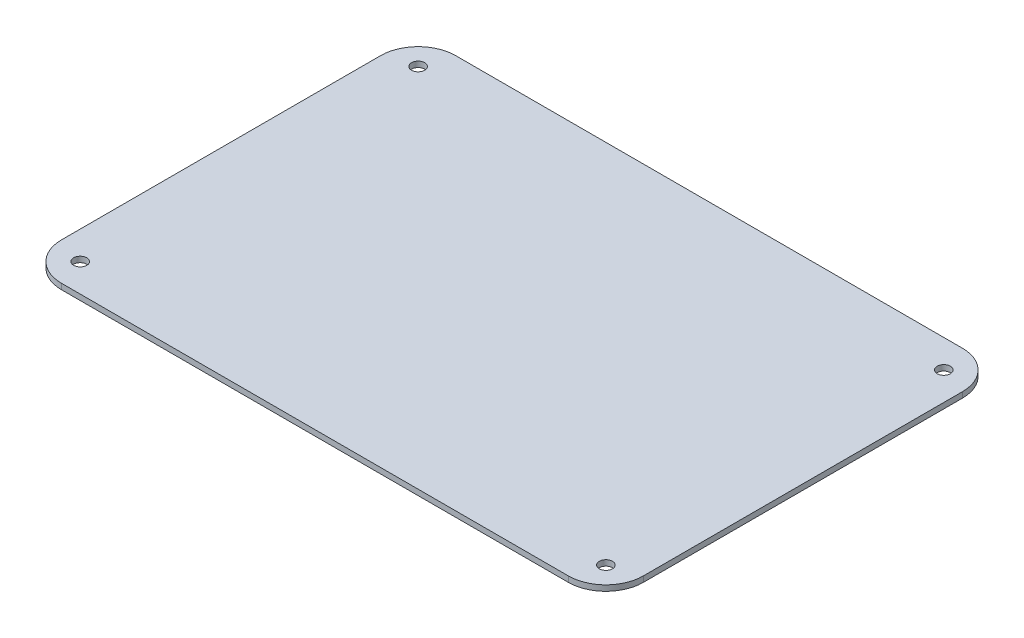
ISO-10303-21;
HEADER;
FILE_DESCRIPTION(('STEP AP214'),'2;1');
FILE_NAME('part.step','',(''),(''),'','','');
FILE_SCHEMA(('AUTOMOTIVE_DESIGN { 1 0 10303 214 1 1 1 1 }'));
ENDSEC;
DATA;
#1=APPLICATION_CONTEXT('core data for automotive mechanical design processes');
#2=APPLICATION_PROTOCOL_DEFINITION('international standard','automotive_design',2000,#1);
#3=PRODUCT_CONTEXT('',#1,'mechanical');
#4=PRODUCT('Part','Part','',(#3));
#5=PRODUCT_RELATED_PRODUCT_CATEGORY('part','',(#4));
#6=PRODUCT_DEFINITION_FORMATION('','',#4);
#7=PRODUCT_DEFINITION_CONTEXT('part definition',#1,'design');
#8=PRODUCT_DEFINITION('design','',#6,#7);
#9=PRODUCT_DEFINITION_SHAPE('','',#8);
#10=(LENGTH_UNIT() NAMED_UNIT(*) SI_UNIT(.MILLI.,.METRE.));
#11=(NAMED_UNIT(*) PLANE_ANGLE_UNIT() SI_UNIT($,.RADIAN.));
#12=(NAMED_UNIT(*) SI_UNIT($,.STERADIAN.) SOLID_ANGLE_UNIT());
#13=UNCERTAINTY_MEASURE_WITH_UNIT(LENGTH_MEASURE(1.E-05),#10,'distance_accuracy_value','');
#14=(GEOMETRIC_REPRESENTATION_CONTEXT(3) GLOBAL_UNCERTAINTY_ASSIGNED_CONTEXT((#13)) GLOBAL_UNIT_ASSIGNED_CONTEXT((#10,
#11,#12)) REPRESENTATION_CONTEXT('',''));
#15=CARTESIAN_POINT('',(0.,0.,0.));
#16=DIRECTION('',(0.,0.,1.));
#17=DIRECTION('',(1.,0.,0.));
#18=AXIS2_PLACEMENT_3D('',#15,#16,#17);
#19=CARTESIAN_POINT('',(0.,3.,0.));
#20=DIRECTION('',(0.,-1.,0.));
#21=DIRECTION('',(0.,0.,-1.));
#22=AXIS2_PLACEMENT_3D('',#19,#20,#21);
#23=PLANE('',#22);
#24=DIRECTION('',(1.,0.,0.));
#25=VECTOR('',#24,1.);
#26=CARTESIAN_POINT('',(155.,3.,105.));
#27=LINE('',#26,#25);
#28=CARTESIAN_POINT('',(-135.,3.,105.));
#29=VERTEX_POINT('',#28);
#30=CARTESIAN_POINT('',(135.,3.,105.));
#31=VERTEX_POINT('',#30);
#32=EDGE_CURVE('E194',#29,#31,#27,.T.);
#33=ORIENTED_EDGE('',*,*,#32,.T.);
#34=CARTESIAN_POINT('',(135.,3.,85.));
#35=DIRECTION('',(0.,-1.,0.));
#36=DIRECTION('',(0.,0.,-1.));
#37=AXIS2_PLACEMENT_3D('',#34,#35,#36);
#38=CIRCLE('',#37,20.);
#39=CARTESIAN_POINT('',(155.,3.,85.));
#40=VERTEX_POINT('',#39);
#41=EDGE_CURVE('E170',#31,#40,#38,.F.);
#42=ORIENTED_EDGE('',*,*,#41,.T.);
#43=DIRECTION('',(0.,0.,-1.));
#44=VECTOR('',#43,1.);
#45=CARTESIAN_POINT('',(155.,3.,-105.));
#46=LINE('',#45,#44);
#47=CARTESIAN_POINT('',(155.,3.,-85.));
#48=VERTEX_POINT('',#47);
#49=EDGE_CURVE('E127',#40,#48,#46,.T.);
#50=ORIENTED_EDGE('',*,*,#49,.T.);
#51=CARTESIAN_POINT('',(135.,3.,-85.));
#52=DIRECTION('',(0.,-1.,0.));
#53=DIRECTION('',(0.,0.,-1.));
#54=AXIS2_PLACEMENT_3D('',#51,#52,#53);
#55=CIRCLE('',#54,20.);
#56=CARTESIAN_POINT('',(135.,3.,-105.));
#57=VERTEX_POINT('',#56);
#58=EDGE_CURVE('E62',#48,#57,#55,.F.);
#59=ORIENTED_EDGE('',*,*,#58,.T.);
#60=DIRECTION('',(-1.,0.,0.));
#61=VECTOR('',#60,1.);
#62=CARTESIAN_POINT('',(155.,3.,-105.));
#63=LINE('',#62,#61);
#64=CARTESIAN_POINT('',(-135.,3.,-105.));
#65=VERTEX_POINT('',#64);
#66=EDGE_CURVE('E148',#57,#65,#63,.T.);
#67=ORIENTED_EDGE('',*,*,#66,.T.);
#68=CARTESIAN_POINT('',(-135.,3.,-85.));
#69=DIRECTION('',(0.,-1.,0.));
#70=DIRECTION('',(0.,0.,-1.));
#71=AXIS2_PLACEMENT_3D('',#68,#69,#70);
#72=CIRCLE('',#71,20.);
#73=CARTESIAN_POINT('',(-155.,3.,-85.));
#74=VERTEX_POINT('',#73);
#75=EDGE_CURVE('E165',#65,#74,#72,.F.);
#76=ORIENTED_EDGE('',*,*,#75,.T.);
#77=DIRECTION('',(0.,0.,1.));
#78=VECTOR('',#77,1.);
#79=CARTESIAN_POINT('',(-155.,3.,-105.));
#80=LINE('',#79,#78);
#81=CARTESIAN_POINT('',(-155.,3.,85.));
#82=VERTEX_POINT('',#81);
#83=EDGE_CURVE('E141',#74,#82,#80,.T.);
#84=ORIENTED_EDGE('',*,*,#83,.T.);
#85=CARTESIAN_POINT('',(-135.,3.,85.));
#86=DIRECTION('',(0.,-1.,0.));
#87=DIRECTION('',(0.,0.,-1.));
#88=AXIS2_PLACEMENT_3D('',#85,#86,#87);
#89=CIRCLE('',#88,20.);
#90=EDGE_CURVE('E162',#82,#29,#89,.F.);
#91=ORIENTED_EDGE('',*,*,#90,.T.);
#92=EDGE_LOOP('',(#33,#42,#50,#59,#67,#76,#84,#91));
#93=FACE_BOUND('',#92,.T.);
#94=CARTESIAN_POINT('',(-140.,3.,-90.));
#95=DIRECTION('',(0.,1.,0.));
#96=DIRECTION('',(0.,0.,1.));
#97=AXIS2_PLACEMENT_3D('',#94,#95,#96);
#98=CIRCLE('',#97,3.49999999999999);
#99=CARTESIAN_POINT('',(-140.,3.,-86.5));
#100=VERTEX_POINT('',#99);
#101=EDGE_CURVE('E200',#100,#100,#98,.T.);
#102=ORIENTED_EDGE('',*,*,#101,.F.);
#103=EDGE_LOOP('',(#102));
#104=FACE_BOUND('',#103,.T.);
#105=CARTESIAN_POINT('',(140.,3.,-90.));
#106=DIRECTION('',(0.,1.,0.));
#107=DIRECTION('',(0.,0.,1.));
#108=AXIS2_PLACEMENT_3D('',#105,#106,#107);
#109=CIRCLE('',#108,3.49999999999999);
#110=CARTESIAN_POINT('',(140.,3.,-86.5));
#111=VERTEX_POINT('',#110);
#112=EDGE_CURVE('E214',#111,#111,#109,.T.);
#113=ORIENTED_EDGE('',*,*,#112,.F.);
#114=EDGE_LOOP('',(#113));
#115=FACE_BOUND('',#114,.T.);
#116=CARTESIAN_POINT('',(140.,3.,90.));
#117=DIRECTION('',(0.,1.,0.));
#118=DIRECTION('',(0.,0.,1.));
#119=AXIS2_PLACEMENT_3D('',#116,#117,#118);
#120=CIRCLE('',#119,3.49999999999999);
#121=CARTESIAN_POINT('',(140.,3.,93.5));
#122=VERTEX_POINT('',#121);
#123=EDGE_CURVE('E220',#122,#122,#120,.T.);
#124=ORIENTED_EDGE('',*,*,#123,.F.);
#125=EDGE_LOOP('',(#124));
#126=FACE_BOUND('',#125,.T.);
#127=CARTESIAN_POINT('',(-140.,3.,90.));
#128=DIRECTION('',(0.,1.,0.));
#129=DIRECTION('',(0.,0.,1.));
#130=AXIS2_PLACEMENT_3D('',#127,#128,#129);
#131=CIRCLE('',#130,3.49999999999999);
#132=CARTESIAN_POINT('',(-140.,3.,93.5));
#133=VERTEX_POINT('',#132);
#134=EDGE_CURVE('E228',#133,#133,#131,.T.);
#135=ORIENTED_EDGE('',*,*,#134,.F.);
#136=EDGE_LOOP('',(#135));
#137=FACE_BOUND('',#136,.T.);
#138=ADVANCED_FACE('F39',(#93,#104,#115,#126,#137),#23,.F.);
#139=CARTESIAN_POINT('',(0.,0.,0.));
#140=DIRECTION('',(0.,-1.,0.));
#141=DIRECTION('',(0.,0.,-1.));
#142=AXIS2_PLACEMENT_3D('',#139,#140,#141);
#143=PLANE('',#142);
#144=CARTESIAN_POINT('',(140.,0.,90.));
#145=DIRECTION('',(0.,1.,0.));
#146=DIRECTION('',(0.,0.,1.));
#147=AXIS2_PLACEMENT_3D('',#144,#145,#146);
#148=CIRCLE('',#147,3.49999999999999);
#149=CARTESIAN_POINT('',(140.,0.,93.5));
#150=VERTEX_POINT('',#149);
#151=EDGE_CURVE('E224',#150,#150,#148,.T.);
#152=ORIENTED_EDGE('',*,*,#151,.T.);
#153=EDGE_LOOP('',(#152));
#154=FACE_BOUND('',#153,.T.);
#155=CARTESIAN_POINT('',(-140.,0.,-90.));
#156=DIRECTION('',(0.,1.,0.));
#157=DIRECTION('',(0.,0.,1.));
#158=AXIS2_PLACEMENT_3D('',#155,#156,#157);
#159=CIRCLE('',#158,3.49999999999999);
#160=CARTESIAN_POINT('',(-140.,0.,-86.5));
#161=VERTEX_POINT('',#160);
#162=EDGE_CURVE('E203',#161,#161,#159,.T.);
#163=ORIENTED_EDGE('',*,*,#162,.T.);
#164=EDGE_LOOP('',(#163));
#165=FACE_BOUND('',#164,.T.);
#166=DIRECTION('',(0.,0.,-1.));
#167=VECTOR('',#166,1.);
#168=CARTESIAN_POINT('',(155.,0.,-105.));
#169=LINE('',#168,#167);
#170=CARTESIAN_POINT('',(155.,0.,85.));
#171=VERTEX_POINT('',#170);
#172=CARTESIAN_POINT('',(155.,0.,-85.));
#173=VERTEX_POINT('',#172);
#174=EDGE_CURVE('E125',#171,#173,#169,.T.);
#175=ORIENTED_EDGE('',*,*,#174,.F.);
#176=CARTESIAN_POINT('',(135.,0.,85.));
#177=DIRECTION('',(0.,-1.,0.));
#178=DIRECTION('',(0.,0.,-1.));
#179=AXIS2_PLACEMENT_3D('',#176,#177,#178);
#180=CIRCLE('',#179,20.);
#181=CARTESIAN_POINT('',(135.,0.,105.));
#182=VERTEX_POINT('',#181);
#183=EDGE_CURVE('E107',#171,#182,#180,.T.);
#184=ORIENTED_EDGE('',*,*,#183,.T.);
#185=DIRECTION('',(1.,0.,0.));
#186=VECTOR('',#185,1.);
#187=CARTESIAN_POINT('',(155.,0.,105.));
#188=LINE('',#187,#186);
#189=CARTESIAN_POINT('',(-135.,0.,105.));
#190=VERTEX_POINT('',#189);
#191=EDGE_CURVE('E137',#190,#182,#188,.T.);
#192=ORIENTED_EDGE('',*,*,#191,.F.);
#193=CARTESIAN_POINT('',(-135.,0.,85.));
#194=DIRECTION('',(0.,-1.,0.));
#195=DIRECTION('',(0.,0.,-1.));
#196=AXIS2_PLACEMENT_3D('',#193,#194,#195);
#197=CIRCLE('',#196,20.);
#198=CARTESIAN_POINT('',(-155.,0.,85.));
#199=VERTEX_POINT('',#198);
#200=EDGE_CURVE('E129',#190,#199,#197,.T.);
#201=ORIENTED_EDGE('',*,*,#200,.T.);
#202=DIRECTION('',(0.,0.,1.));
#203=VECTOR('',#202,1.);
#204=CARTESIAN_POINT('',(-155.,0.,-105.));
#205=LINE('',#204,#203);
#206=CARTESIAN_POINT('',(-155.,0.,-85.));
#207=VERTEX_POINT('',#206);
#208=EDGE_CURVE('E143',#207,#199,#205,.T.);
#209=ORIENTED_EDGE('',*,*,#208,.F.);
#210=CARTESIAN_POINT('',(-135.,0.,-85.));
#211=DIRECTION('',(0.,-1.,0.));
#212=DIRECTION('',(0.,0.,-1.));
#213=AXIS2_PLACEMENT_3D('',#210,#211,#212);
#214=CIRCLE('',#213,20.);
#215=CARTESIAN_POINT('',(-135.,0.,-105.));
#216=VERTEX_POINT('',#215);
#217=EDGE_CURVE('E152',#207,#216,#214,.T.);
#218=ORIENTED_EDGE('',*,*,#217,.T.);
#219=DIRECTION('',(-1.,0.,0.));
#220=VECTOR('',#219,1.);
#221=CARTESIAN_POINT('',(155.,0.,-105.));
#222=LINE('',#221,#220);
#223=CARTESIAN_POINT('',(135.,0.,-105.));
#224=VERTEX_POINT('',#223);
#225=EDGE_CURVE('E136',#224,#216,#222,.T.);
#226=ORIENTED_EDGE('',*,*,#225,.F.);
#227=CARTESIAN_POINT('',(135.,0.,-85.));
#228=DIRECTION('',(0.,-1.,0.));
#229=DIRECTION('',(0.,0.,-1.));
#230=AXIS2_PLACEMENT_3D('',#227,#228,#229);
#231=CIRCLE('',#230,20.);
#232=EDGE_CURVE('E119',#224,#173,#231,.T.);
#233=ORIENTED_EDGE('',*,*,#232,.T.);
#234=EDGE_LOOP('',(#175,#184,#192,#201,#209,#218,#226,#233));
#235=FACE_BOUND('',#234,.T.);
#236=CARTESIAN_POINT('',(140.,0.,-90.));
#237=DIRECTION('',(0.,1.,0.));
#238=DIRECTION('',(0.,0.,1.));
#239=AXIS2_PLACEMENT_3D('',#236,#237,#238);
#240=CIRCLE('',#239,3.49999999999999);
#241=CARTESIAN_POINT('',(140.,0.,-86.5));
#242=VERTEX_POINT('',#241);
#243=EDGE_CURVE('E216',#242,#242,#240,.T.);
#244=ORIENTED_EDGE('',*,*,#243,.T.);
#245=EDGE_LOOP('',(#244));
#246=FACE_BOUND('',#245,.T.);
#247=CARTESIAN_POINT('',(-140.,0.,90.));
#248=DIRECTION('',(0.,1.,0.));
#249=DIRECTION('',(0.,0.,1.));
#250=AXIS2_PLACEMENT_3D('',#247,#248,#249);
#251=CIRCLE('',#250,3.49999999999999);
#252=CARTESIAN_POINT('',(-140.,0.,93.5));
#253=VERTEX_POINT('',#252);
#254=EDGE_CURVE('E232',#253,#253,#251,.T.);
#255=ORIENTED_EDGE('',*,*,#254,.T.);
#256=EDGE_LOOP('',(#255));
#257=FACE_BOUND('',#256,.T.);
#258=ADVANCED_FACE('F132',(#154,#165,#235,#246,#257),#143,.T.);
#259=CARTESIAN_POINT('',(-155.,3.,-105.));
#260=DIRECTION('',(1.,0.,0.));
#261=DIRECTION('',(0.,0.,-1.));
#262=AXIS2_PLACEMENT_3D('',#259,#260,#261);
#263=PLANE('',#262);
#264=ORIENTED_EDGE('',*,*,#83,.F.);
#265=DIRECTION('',(0.,-1.,0.));
#266=VECTOR('',#265,1.);
#267=CARTESIAN_POINT('',(-155.,3.,-85.));
#268=LINE('',#267,#266);
#269=EDGE_CURVE('E11',#74,#207,#268,.T.);
#270=ORIENTED_EDGE('',*,*,#269,.T.);
#271=ORIENTED_EDGE('',*,*,#208,.T.);
#272=DIRECTION('',(0.,-1.,0.));
#273=VECTOR('',#272,1.);
#274=CARTESIAN_POINT('',(-155.,3.,85.));
#275=LINE('',#274,#273);
#276=EDGE_CURVE('E48',#199,#82,#275,.F.);
#277=ORIENTED_EDGE('',*,*,#276,.T.);
#278=EDGE_LOOP('',(#264,#270,#271,#277));
#279=FACE_BOUND('',#278,.T.);
#280=ADVANCED_FACE('F184',(#279),#263,.F.);
#281=CARTESIAN_POINT('',(155.,3.,105.));
#282=DIRECTION('',(0.,0.,-1.));
#283=DIRECTION('',(-1.,0.,0.));
#284=AXIS2_PLACEMENT_3D('',#281,#282,#283);
#285=PLANE('',#284);
#286=ORIENTED_EDGE('',*,*,#191,.T.);
#287=DIRECTION('',(0.,-1.,0.));
#288=VECTOR('',#287,1.);
#289=CARTESIAN_POINT('',(135.,3.,105.));
#290=LINE('',#289,#288);
#291=EDGE_CURVE('E112',#182,#31,#290,.F.);
#292=ORIENTED_EDGE('',*,*,#291,.T.);
#293=ORIENTED_EDGE('',*,*,#32,.F.);
#294=DIRECTION('',(0.,-1.,0.));
#295=VECTOR('',#294,1.);
#296=CARTESIAN_POINT('',(-135.,3.,105.));
#297=LINE('',#296,#295);
#298=EDGE_CURVE('E118',#29,#190,#297,.T.);
#299=ORIENTED_EDGE('',*,*,#298,.T.);
#300=EDGE_LOOP('',(#286,#292,#293,#299));
#301=FACE_BOUND('',#300,.T.);
#302=ADVANCED_FACE('F198',(#301),#285,.F.);
#303=CARTESIAN_POINT('',(155.,3.,-105.));
#304=DIRECTION('',(-1.,0.,0.));
#305=DIRECTION('',(0.,0.,1.));
#306=AXIS2_PLACEMENT_3D('',#303,#304,#305);
#307=PLANE('',#306);
#308=ORIENTED_EDGE('',*,*,#49,.F.);
#309=DIRECTION('',(0.,-1.,0.));
#310=VECTOR('',#309,1.);
#311=CARTESIAN_POINT('',(155.,3.,85.));
#312=LINE('',#311,#310);
#313=EDGE_CURVE('E111',#40,#171,#312,.T.);
#314=ORIENTED_EDGE('',*,*,#313,.T.);
#315=ORIENTED_EDGE('',*,*,#174,.T.);
#316=DIRECTION('',(0.,-1.,0.));
#317=VECTOR('',#316,1.);
#318=CARTESIAN_POINT('',(155.,3.,-85.));
#319=LINE('',#318,#317);
#320=EDGE_CURVE('E130',#173,#48,#319,.F.);
#321=ORIENTED_EDGE('',*,*,#320,.T.);
#322=EDGE_LOOP('',(#308,#314,#315,#321));
#323=FACE_BOUND('',#322,.T.);
#324=ADVANCED_FACE('F124',(#323),#307,.F.);
#325=CARTESIAN_POINT('',(155.,3.,-105.));
#326=DIRECTION('',(0.,0.,1.));
#327=DIRECTION('',(1.,0.,0.));
#328=AXIS2_PLACEMENT_3D('',#325,#326,#327);
#329=PLANE('',#328);
#330=ORIENTED_EDGE('',*,*,#66,.F.);
#331=DIRECTION('',(0.,-1.,0.));
#332=VECTOR('',#331,1.);
#333=CARTESIAN_POINT('',(135.,3.,-105.));
#334=LINE('',#333,#332);
#335=EDGE_CURVE('E175',#57,#224,#334,.T.);
#336=ORIENTED_EDGE('',*,*,#335,.T.);
#337=ORIENTED_EDGE('',*,*,#225,.T.);
#338=DIRECTION('',(0.,-1.,0.));
#339=VECTOR('',#338,1.);
#340=CARTESIAN_POINT('',(-135.,3.,-105.));
#341=LINE('',#340,#339);
#342=EDGE_CURVE('E55',#216,#65,#341,.F.);
#343=ORIENTED_EDGE('',*,*,#342,.T.);
#344=EDGE_LOOP('',(#330,#336,#337,#343));
#345=FACE_BOUND('',#344,.T.);
#346=ADVANCED_FACE('F254',(#345),#329,.F.);
#347=CARTESIAN_POINT('',(-140.,3.,-90.));
#348=DIRECTION('',(0.,-1.,0.));
#349=DIRECTION('',(0.,0.,-1.));
#350=AXIS2_PLACEMENT_3D('',#347,#348,#349);
#351=CYLINDRICAL_SURFACE('',#350,3.49999999999999);
#352=ORIENTED_EDGE('',*,*,#101,.T.);
#353=EDGE_LOOP('',(#352));
#354=FACE_BOUND('',#353,.T.);
#355=ORIENTED_EDGE('',*,*,#162,.F.);
#356=EDGE_LOOP('',(#355));
#357=FACE_BOUND('',#356,.T.);
#358=ADVANCED_FACE('F251',(#354,#357),#351,.F.);
#359=CARTESIAN_POINT('',(140.,3.,-90.));
#360=DIRECTION('',(0.,-1.,0.));
#361=DIRECTION('',(0.,0.,-1.));
#362=AXIS2_PLACEMENT_3D('',#359,#360,#361);
#363=CYLINDRICAL_SURFACE('',#362,3.49999999999999);
#364=ORIENTED_EDGE('',*,*,#112,.T.);
#365=EDGE_LOOP('',(#364));
#366=FACE_BOUND('',#365,.T.);
#367=ORIENTED_EDGE('',*,*,#243,.F.);
#368=EDGE_LOOP('',(#367));
#369=FACE_BOUND('',#368,.T.);
#370=ADVANCED_FACE('F346',(#366,#369),#363,.F.);
#371=CARTESIAN_POINT('',(140.,3.,90.));
#372=DIRECTION('',(0.,-1.,0.));
#373=DIRECTION('',(0.,0.,-1.));
#374=AXIS2_PLACEMENT_3D('',#371,#372,#373);
#375=CYLINDRICAL_SURFACE('',#374,3.49999999999999);
#376=ORIENTED_EDGE('',*,*,#123,.T.);
#377=EDGE_LOOP('',(#376));
#378=FACE_BOUND('',#377,.T.);
#379=ORIENTED_EDGE('',*,*,#151,.F.);
#380=EDGE_LOOP('',(#379));
#381=FACE_BOUND('',#380,.T.);
#382=ADVANCED_FACE('F337',(#378,#381),#375,.F.);
#383=CARTESIAN_POINT('',(-140.,3.,90.));
#384=DIRECTION('',(0.,-1.,0.));
#385=DIRECTION('',(0.,0.,-1.));
#386=AXIS2_PLACEMENT_3D('',#383,#384,#385);
#387=CYLINDRICAL_SURFACE('',#386,3.49999999999999);
#388=ORIENTED_EDGE('',*,*,#134,.T.);
#389=EDGE_LOOP('',(#388));
#390=FACE_BOUND('',#389,.T.);
#391=ORIENTED_EDGE('',*,*,#254,.F.);
#392=EDGE_LOOP('',(#391));
#393=FACE_BOUND('',#392,.T.);
#394=ADVANCED_FACE('F240',(#390,#393),#387,.F.);
#395=CARTESIAN_POINT('',(135.,3.,85.));
#396=DIRECTION('',(0.,-1.,0.));
#397=DIRECTION('',(0.,0.,-1.));
#398=AXIS2_PLACEMENT_3D('',#395,#396,#397);
#399=CYLINDRICAL_SURFACE('',#398,20.);
#400=ORIENTED_EDGE('',*,*,#41,.F.);
#401=ORIENTED_EDGE('',*,*,#291,.F.);
#402=ORIENTED_EDGE('',*,*,#183,.F.);
#403=ORIENTED_EDGE('',*,*,#313,.F.);
#404=EDGE_LOOP('',(#400,#401,#402,#403));
#405=FACE_BOUND('',#404,.T.);
#406=ADVANCED_FACE('F110',(#405),#399,.T.);
#407=CARTESIAN_POINT('',(135.,3.,-85.));
#408=DIRECTION('',(0.,-1.,0.));
#409=DIRECTION('',(0.,0.,-1.));
#410=AXIS2_PLACEMENT_3D('',#407,#408,#409);
#411=CYLINDRICAL_SURFACE('',#410,20.);
#412=ORIENTED_EDGE('',*,*,#58,.F.);
#413=ORIENTED_EDGE('',*,*,#320,.F.);
#414=ORIENTED_EDGE('',*,*,#232,.F.);
#415=ORIENTED_EDGE('',*,*,#335,.F.);
#416=EDGE_LOOP('',(#412,#413,#414,#415));
#417=FACE_BOUND('',#416,.T.);
#418=ADVANCED_FACE('F265',(#417),#411,.T.);
#419=CARTESIAN_POINT('',(-135.,3.,-85.));
#420=DIRECTION('',(0.,-1.,0.));
#421=DIRECTION('',(0.,0.,-1.));
#422=AXIS2_PLACEMENT_3D('',#419,#420,#421);
#423=CYLINDRICAL_SURFACE('',#422,20.);
#424=ORIENTED_EDGE('',*,*,#75,.F.);
#425=ORIENTED_EDGE('',*,*,#342,.F.);
#426=ORIENTED_EDGE('',*,*,#217,.F.);
#427=ORIENTED_EDGE('',*,*,#269,.F.);
#428=EDGE_LOOP('',(#424,#425,#426,#427));
#429=FACE_BOUND('',#428,.T.);
#430=ADVANCED_FACE('F267',(#429),#423,.T.);
#431=CARTESIAN_POINT('',(-135.,3.,85.));
#432=DIRECTION('',(0.,-1.,0.));
#433=DIRECTION('',(0.,0.,-1.));
#434=AXIS2_PLACEMENT_3D('',#431,#432,#433);
#435=CYLINDRICAL_SURFACE('',#434,20.);
#436=ORIENTED_EDGE('',*,*,#90,.F.);
#437=ORIENTED_EDGE('',*,*,#276,.F.);
#438=ORIENTED_EDGE('',*,*,#200,.F.);
#439=ORIENTED_EDGE('',*,*,#298,.F.);
#440=EDGE_LOOP('',(#436,#437,#438,#439));
#441=FACE_BOUND('',#440,.T.);
#442=ADVANCED_FACE('F41',(#441),#435,.T.);
#443=CLOSED_SHELL('',(#138,#258,#280,#302,#324,#346,#358,#370,#382,#394,#406,#418,#430,#442));
#444=MANIFOLD_SOLID_BREP('B2',#443);
#445=ADVANCED_BREP_SHAPE_REPRESENTATION('',(#18,#444),#14);
#446=SHAPE_DEFINITION_REPRESENTATION(#9,#445);
ENDSEC;
END-ISO-10303-21;
